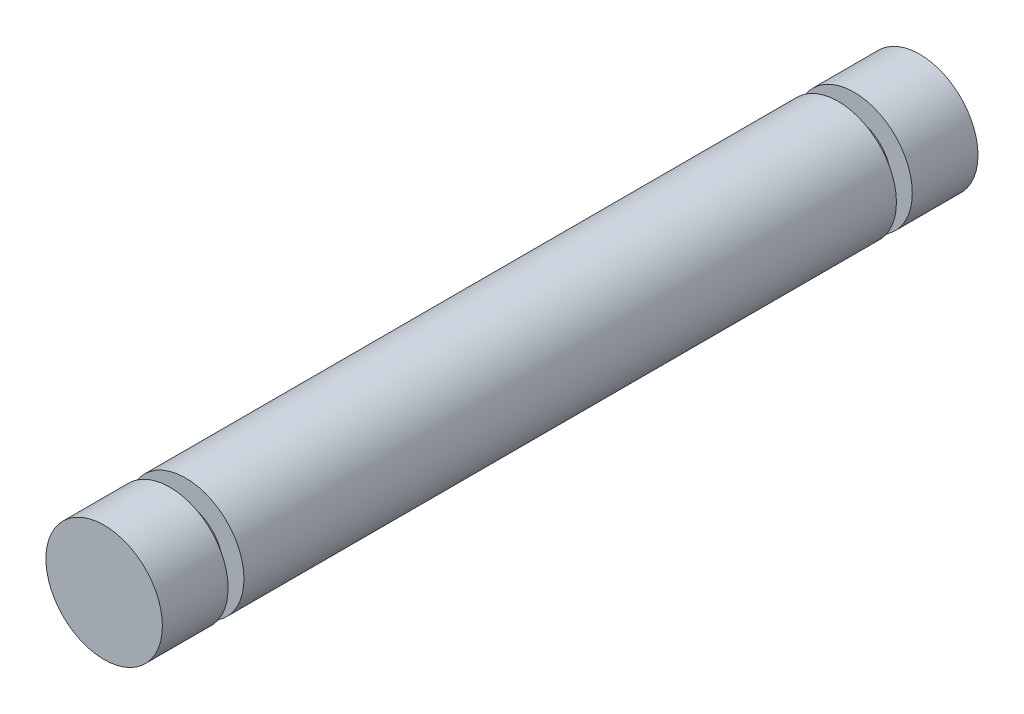
ISO-10303-21;
HEADER;
FILE_DESCRIPTION(('STEP AP214'),'2;1');
FILE_NAME('part.step','',(''),(''),'','','');
FILE_SCHEMA(('AUTOMOTIVE_DESIGN { 1 0 10303 214 1 1 1 1 }'));
ENDSEC;
DATA;
#1=APPLICATION_CONTEXT('core data for automotive mechanical design processes');
#2=APPLICATION_PROTOCOL_DEFINITION('international standard','automotive_design',2000,#1);
#3=PRODUCT_CONTEXT('',#1,'mechanical');
#4=PRODUCT('Part','Part','',(#3));
#5=PRODUCT_RELATED_PRODUCT_CATEGORY('part','',(#4));
#6=PRODUCT_DEFINITION_FORMATION('','',#4);
#7=PRODUCT_DEFINITION_CONTEXT('part definition',#1,'design');
#8=PRODUCT_DEFINITION('design','',#6,#7);
#9=PRODUCT_DEFINITION_SHAPE('','',#8);
#10=(LENGTH_UNIT() NAMED_UNIT(*) SI_UNIT(.MILLI.,.METRE.));
#11=(NAMED_UNIT(*) PLANE_ANGLE_UNIT() SI_UNIT($,.RADIAN.));
#12=(NAMED_UNIT(*) SI_UNIT($,.STERADIAN.) SOLID_ANGLE_UNIT());
#13=UNCERTAINTY_MEASURE_WITH_UNIT(LENGTH_MEASURE(1.E-05),#10,'distance_accuracy_value','');
#14=(GEOMETRIC_REPRESENTATION_CONTEXT(3) GLOBAL_UNCERTAINTY_ASSIGNED_CONTEXT((#13)) GLOBAL_UNIT_ASSIGNED_CONTEXT((#10,
#11,#12)) REPRESENTATION_CONTEXT('',''));
#15=CARTESIAN_POINT('',(0.,0.,0.));
#16=DIRECTION('',(0.,0.,1.));
#17=DIRECTION('',(1.,0.,0.));
#18=AXIS2_PLACEMENT_3D('',#15,#16,#17);
#19=CARTESIAN_POINT('',(0.,0.,35.));
#20=DIRECTION('',(0.,0.,-1.));
#21=DIRECTION('',(-1.,0.,0.));
#22=AXIS2_PLACEMENT_3D('',#19,#20,#21);
#23=CYLINDRICAL_SURFACE('',#22,2.5);
#24=CARTESIAN_POINT('',(0.,0.,35.));
#25=DIRECTION('',(0.,0.,1.));
#26=DIRECTION('',(1.,0.,0.));
#27=AXIS2_PLACEMENT_3D('',#24,#25,#26);
#28=CIRCLE('',#27,2.5);
#29=CARTESIAN_POINT('',(2.5,0.,35.));
#30=VERTEX_POINT('',#29);
#31=EDGE_CURVE('E10',#30,#30,#28,.T.);
#32=ORIENTED_EDGE('',*,*,#31,.F.);
#33=EDGE_LOOP('',(#32));
#34=FACE_BOUND('',#33,.T.);
#35=CARTESIAN_POINT('',(0.,0.,32.18));
#36=DIRECTION('',(0.,0.,1.));
#37=DIRECTION('',(1.,0.,0.));
#38=AXIS2_PLACEMENT_3D('',#35,#36,#37);
#39=CIRCLE('',#38,2.5);
#40=CARTESIAN_POINT('',(2.5,0.,32.18));
#41=VERTEX_POINT('',#40);
#42=EDGE_CURVE('E42',#41,#41,#39,.T.);
#43=ORIENTED_EDGE('',*,*,#42,.T.);
#44=EDGE_LOOP('',(#43));
#45=FACE_BOUND('',#44,.T.);
#46=ADVANCED_FACE('F32',(#34,#45),#23,.T.);
#47=CARTESIAN_POINT('',(0.,0.,35.));
#48=DIRECTION('',(0.,0.,1.));
#49=DIRECTION('',(1.,0.,0.));
#50=AXIS2_PLACEMENT_3D('',#47,#48,#49);
#51=PLANE('',#50);
#52=ORIENTED_EDGE('',*,*,#31,.T.);
#53=EDGE_LOOP('',(#52));
#54=FACE_BOUND('',#53,.T.);
#55=ADVANCED_FACE('F89',(#54),#51,.T.);
#56=CARTESIAN_POINT('',(0.,2.5,32.18));
#57=DIRECTION('',(0.,0.,-1.));
#58=DIRECTION('',(-1.,0.,0.));
#59=AXIS2_PLACEMENT_3D('',#56,#57,#58);
#60=PLANE('',#59);
#61=CARTESIAN_POINT('',(0.,0.,32.18));
#62=DIRECTION('',(0.,0.,1.));
#63=DIRECTION('',(1.,0.,0.));
#64=AXIS2_PLACEMENT_3D('',#61,#62,#63);
#65=CIRCLE('',#64,1.6);
#66=CARTESIAN_POINT('',(1.6,0.,32.18));
#67=VERTEX_POINT('',#66);
#68=EDGE_CURVE('E59',#67,#67,#65,.T.);
#69=ORIENTED_EDGE('',*,*,#68,.T.);
#70=EDGE_LOOP('',(#69));
#71=FACE_BOUND('',#70,.T.);
#72=ORIENTED_EDGE('',*,*,#42,.F.);
#73=EDGE_LOOP('',(#72));
#74=FACE_BOUND('',#73,.T.);
#75=ADVANCED_FACE('F94',(#71,#74),#60,.T.);
#76=CARTESIAN_POINT('',(0.,0.,35.));
#77=DIRECTION('',(0.,0.,1.));
#78=DIRECTION('',(1.,0.,0.));
#79=AXIS2_PLACEMENT_3D('',#76,#77,#78);
#80=CYLINDRICAL_SURFACE('',#79,1.6);
#81=CARTESIAN_POINT('',(0.,0.,31.5));
#82=DIRECTION('',(0.,0.,1.));
#83=DIRECTION('',(1.,0.,0.));
#84=AXIS2_PLACEMENT_3D('',#81,#82,#83);
#85=CIRCLE('',#84,1.6);
#86=CARTESIAN_POINT('',(1.6,0.,31.5));
#87=VERTEX_POINT('',#86);
#88=EDGE_CURVE('E62',#87,#87,#85,.T.);
#89=ORIENTED_EDGE('',*,*,#88,.T.);
#90=EDGE_LOOP('',(#89));
#91=FACE_BOUND('',#90,.T.);
#92=ORIENTED_EDGE('',*,*,#68,.F.);
#93=EDGE_LOOP('',(#92));
#94=FACE_BOUND('',#93,.T.);
#95=ADVANCED_FACE('F83',(#91,#94),#80,.T.);
#96=CARTESIAN_POINT('',(0.,1.6,31.5));
#97=DIRECTION('',(0.,0.,1.));
#98=DIRECTION('',(1.,0.,0.));
#99=AXIS2_PLACEMENT_3D('',#96,#97,#98);
#100=PLANE('',#99);
#101=CARTESIAN_POINT('',(0.,0.,31.5));
#102=DIRECTION('',(0.,0.,1.));
#103=DIRECTION('',(1.,0.,0.));
#104=AXIS2_PLACEMENT_3D('',#101,#102,#103);
#105=CIRCLE('',#104,2.5);
#106=CARTESIAN_POINT('',(2.5,0.,31.5));
#107=VERTEX_POINT('',#106);
#108=EDGE_CURVE('E47',#107,#107,#105,.T.);
#109=ORIENTED_EDGE('',*,*,#108,.T.);
#110=EDGE_LOOP('',(#109));
#111=FACE_BOUND('',#110,.T.);
#112=ORIENTED_EDGE('',*,*,#88,.F.);
#113=EDGE_LOOP('',(#112));
#114=FACE_BOUND('',#113,.T.);
#115=ADVANCED_FACE('F68',(#111,#114),#100,.T.);
#116=CARTESIAN_POINT('',(0.,0.,3.5));
#117=DIRECTION('',(0.,0.,1.));
#118=DIRECTION('',(1.,0.,0.));
#119=AXIS2_PLACEMENT_3D('',#116,#117,#118);
#120=CIRCLE('',#119,2.5);
#121=CARTESIAN_POINT('',(2.5,0.,3.5));
#122=VERTEX_POINT('',#121);
#123=EDGE_CURVE('E51',#122,#122,#120,.T.);
#124=ORIENTED_EDGE('',*,*,#123,.T.);
#125=EDGE_LOOP('',(#124));
#126=FACE_BOUND('',#125,.T.);
#127=ORIENTED_EDGE('',*,*,#108,.F.);
#128=EDGE_LOOP('',(#127));
#129=FACE_BOUND('',#128,.T.);
#130=ADVANCED_FACE('F71',(#126,#129),#23,.T.);
#131=CARTESIAN_POINT('',(0.,2.5,2.82));
#132=DIRECTION('',(0.,0.,1.));
#133=DIRECTION('',(1.,0.,0.));
#134=AXIS2_PLACEMENT_3D('',#131,#132,#133);
#135=PLANE('',#134);
#136=CARTESIAN_POINT('',(0.,0.,2.82));
#137=DIRECTION('',(0.,0.,1.));
#138=DIRECTION('',(1.,0.,0.));
#139=AXIS2_PLACEMENT_3D('',#136,#137,#138);
#140=CIRCLE('',#139,2.5);
#141=CARTESIAN_POINT('',(2.5,0.,2.82));
#142=VERTEX_POINT('',#141);
#143=EDGE_CURVE('E54',#142,#142,#140,.T.);
#144=ORIENTED_EDGE('',*,*,#143,.T.);
#145=EDGE_LOOP('',(#144));
#146=FACE_BOUND('',#145,.T.);
#147=CARTESIAN_POINT('',(0.,0.,2.82));
#148=DIRECTION('',(0.,0.,1.));
#149=DIRECTION('',(1.,0.,0.));
#150=AXIS2_PLACEMENT_3D('',#147,#148,#149);
#151=CIRCLE('',#150,1.6);
#152=CARTESIAN_POINT('',(1.6,0.,2.82));
#153=VERTEX_POINT('',#152);
#154=EDGE_CURVE('E44',#153,#153,#151,.T.);
#155=ORIENTED_EDGE('',*,*,#154,.F.);
#156=EDGE_LOOP('',(#155));
#157=FACE_BOUND('',#156,.T.);
#158=ADVANCED_FACE('F73',(#146,#157),#135,.T.);
#159=CARTESIAN_POINT('',(0.,0.,35.));
#160=DIRECTION('',(0.,0.,1.));
#161=DIRECTION('',(1.,0.,0.));
#162=AXIS2_PLACEMENT_3D('',#159,#160,#161);
#163=CYLINDRICAL_SURFACE('',#162,1.6);
#164=ORIENTED_EDGE('',*,*,#154,.T.);
#165=EDGE_LOOP('',(#164));
#166=FACE_BOUND('',#165,.T.);
#167=CARTESIAN_POINT('',(0.,0.,3.5));
#168=DIRECTION('',(0.,0.,1.));
#169=DIRECTION('',(1.,0.,0.));
#170=AXIS2_PLACEMENT_3D('',#167,#168,#169);
#171=CIRCLE('',#170,1.6);
#172=CARTESIAN_POINT('',(1.6,0.,3.5));
#173=VERTEX_POINT('',#172);
#174=EDGE_CURVE('E48',#173,#173,#171,.T.);
#175=ORIENTED_EDGE('',*,*,#174,.F.);
#176=EDGE_LOOP('',(#175));
#177=FACE_BOUND('',#176,.T.);
#178=ADVANCED_FACE('F80',(#166,#177),#163,.T.);
#179=CARTESIAN_POINT('',(0.,1.6,3.5));
#180=DIRECTION('',(0.,0.,-1.));
#181=DIRECTION('',(-1.,0.,0.));
#182=AXIS2_PLACEMENT_3D('',#179,#180,#181);
#183=PLANE('',#182);
#184=ORIENTED_EDGE('',*,*,#174,.T.);
#185=EDGE_LOOP('',(#184));
#186=FACE_BOUND('',#185,.T.);
#187=ORIENTED_EDGE('',*,*,#123,.F.);
#188=EDGE_LOOP('',(#187));
#189=FACE_BOUND('',#188,.T.);
#190=ADVANCED_FACE('F108',(#186,#189),#183,.T.);
#191=CARTESIAN_POINT('',(0.,0.,0.));
#192=DIRECTION('',(0.,0.,1.));
#193=DIRECTION('',(1.,0.,0.));
#194=AXIS2_PLACEMENT_3D('',#191,#192,#193);
#195=PLANE('',#194);
#196=CARTESIAN_POINT('',(0.,0.,0.));
#197=DIRECTION('',(0.,0.,1.));
#198=DIRECTION('',(1.,0.,0.));
#199=AXIS2_PLACEMENT_3D('',#196,#197,#198);
#200=CIRCLE('',#199,2.5);
#201=CARTESIAN_POINT('',(2.5,0.,0.));
#202=VERTEX_POINT('',#201);
#203=EDGE_CURVE('E35',#202,#202,#200,.T.);
#204=ORIENTED_EDGE('',*,*,#203,.F.);
#205=EDGE_LOOP('',(#204));
#206=FACE_BOUND('',#205,.T.);
#207=ADVANCED_FACE('F86',(#206),#195,.F.);
#208=ORIENTED_EDGE('',*,*,#203,.T.);
#209=EDGE_LOOP('',(#208));
#210=FACE_BOUND('',#209,.T.);
#211=ORIENTED_EDGE('',*,*,#143,.F.);
#212=EDGE_LOOP('',(#211));
#213=FACE_BOUND('',#212,.T.);
#214=ADVANCED_FACE('F75',(#210,#213),#23,.T.);
#215=CLOSED_SHELL('',(#46,#55,#75,#95,#115,#130,#158,#178,#190,#207,#214));
#216=MANIFOLD_SOLID_BREP('B2',#215);
#217=ADVANCED_BREP_SHAPE_REPRESENTATION('',(#18,#216),#14);
#218=SHAPE_DEFINITION_REPRESENTATION(#9,#217);
ENDSEC;
END-ISO-10303-21;
